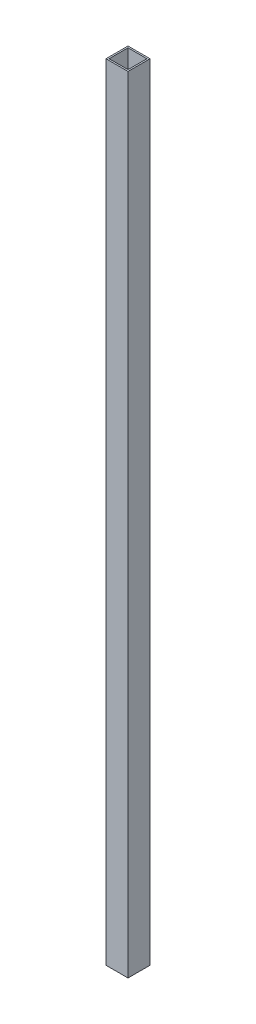
ISO-10303-21;
HEADER;
FILE_DESCRIPTION(('STEP AP214'),'2;1');
FILE_NAME('part.step','',(''),(''),'','','');
FILE_SCHEMA(('AUTOMOTIVE_DESIGN { 1 0 10303 214 1 1 1 1 }'));
ENDSEC;
DATA;
#1=APPLICATION_CONTEXT('core data for automotive mechanical design processes');
#2=APPLICATION_PROTOCOL_DEFINITION('international standard','automotive_design',2000,#1);
#3=PRODUCT_CONTEXT('',#1,'mechanical');
#4=PRODUCT('Part','Part','',(#3));
#5=PRODUCT_RELATED_PRODUCT_CATEGORY('part','',(#4));
#6=PRODUCT_DEFINITION_FORMATION('','',#4);
#7=PRODUCT_DEFINITION_CONTEXT('part definition',#1,'design');
#8=PRODUCT_DEFINITION('design','',#6,#7);
#9=PRODUCT_DEFINITION_SHAPE('','',#8);
#10=(LENGTH_UNIT() NAMED_UNIT(*) SI_UNIT(.MILLI.,.METRE.));
#11=(NAMED_UNIT(*) PLANE_ANGLE_UNIT() SI_UNIT($,.RADIAN.));
#12=(NAMED_UNIT(*) SI_UNIT($,.STERADIAN.) SOLID_ANGLE_UNIT());
#13=UNCERTAINTY_MEASURE_WITH_UNIT(LENGTH_MEASURE(1.E-05),#10,'distance_accuracy_value','');
#14=(GEOMETRIC_REPRESENTATION_CONTEXT(3) GLOBAL_UNCERTAINTY_ASSIGNED_CONTEXT((#13)) GLOBAL_UNIT_ASSIGNED_CONTEXT((#10,
#11,#12)) REPRESENTATION_CONTEXT('',''));
#15=CARTESIAN_POINT('',(0.,0.,0.));
#16=DIRECTION('',(0.,0.,1.));
#17=DIRECTION('',(1.,0.,0.));
#18=AXIS2_PLACEMENT_3D('',#15,#16,#17);
#19=CARTESIAN_POINT('',(0.,606.,0.));
#20=DIRECTION('',(0.,1.,0.));
#21=DIRECTION('',(0.,0.,1.));
#22=AXIS2_PLACEMENT_3D('',#19,#20,#21);
#23=PLANE('',#22);
#24=DIRECTION('',(0.,0.,1.));
#25=VECTOR('',#24,1.);
#26=CARTESIAN_POINT('',(-8.5,606.,-8.5));
#27=LINE('',#26,#25);
#28=CARTESIAN_POINT('',(-8.5,606.,-8.5));
#29=VERTEX_POINT('',#28);
#30=CARTESIAN_POINT('',(-8.5,606.,8.5));
#31=VERTEX_POINT('',#30);
#32=EDGE_CURVE('E176',#29,#31,#27,.T.);
#33=ORIENTED_EDGE('',*,*,#32,.T.);
#34=DIRECTION('',(1.,0.,0.));
#35=VECTOR('',#34,1.);
#36=CARTESIAN_POINT('',(-8.5,606.,8.5));
#37=LINE('',#36,#35);
#38=CARTESIAN_POINT('',(8.5,606.,8.5));
#39=VERTEX_POINT('',#38);
#40=EDGE_CURVE('E180',#31,#39,#37,.T.);
#41=ORIENTED_EDGE('',*,*,#40,.T.);
#42=DIRECTION('',(0.,0.,1.));
#43=VECTOR('',#42,1.);
#44=CARTESIAN_POINT('',(8.5,606.,-8.5));
#45=LINE('',#44,#43);
#46=CARTESIAN_POINT('',(8.5,606.,-8.5));
#47=VERTEX_POINT('',#46);
#48=EDGE_CURVE('E184',#47,#39,#45,.T.);
#49=ORIENTED_EDGE('',*,*,#48,.F.);
#50=DIRECTION('',(1.,0.,0.));
#51=VECTOR('',#50,1.);
#52=CARTESIAN_POINT('',(-8.5,606.,-8.5));
#53=LINE('',#52,#51);
#54=EDGE_CURVE('E188',#29,#47,#53,.T.);
#55=ORIENTED_EDGE('',*,*,#54,.F.);
#56=EDGE_LOOP('',(#33,#41,#49,#55));
#57=FACE_BOUND('',#56,.T.);
#58=DIRECTION('',(1.,0.,0.));
#59=VECTOR('',#58,1.);
#60=CARTESIAN_POINT('',(-7.3,606.,7.3));
#61=LINE('',#60,#59);
#62=CARTESIAN_POINT('',(-7.3,606.,7.3));
#63=VERTEX_POINT('',#62);
#64=CARTESIAN_POINT('',(7.3,606.,7.3));
#65=VERTEX_POINT('',#64);
#66=EDGE_CURVE('E139',#63,#65,#61,.T.);
#67=ORIENTED_EDGE('',*,*,#66,.F.);
#68=DIRECTION('',(0.,0.,1.));
#69=VECTOR('',#68,1.);
#70=CARTESIAN_POINT('',(-7.3,606.,-7.3));
#71=LINE('',#70,#69);
#72=CARTESIAN_POINT('',(-7.3,606.,-7.3));
#73=VERTEX_POINT('',#72);
#74=EDGE_CURVE('E129',#73,#63,#71,.T.);
#75=ORIENTED_EDGE('',*,*,#74,.F.);
#76=DIRECTION('',(1.,0.,0.));
#77=VECTOR('',#76,1.);
#78=CARTESIAN_POINT('',(-7.3,606.,-7.3));
#79=LINE('',#78,#77);
#80=CARTESIAN_POINT('',(7.3,606.,-7.3));
#81=VERTEX_POINT('',#80);
#82=EDGE_CURVE('E153',#73,#81,#79,.T.);
#83=ORIENTED_EDGE('',*,*,#82,.T.);
#84=DIRECTION('',(0.,0.,1.));
#85=VECTOR('',#84,1.);
#86=CARTESIAN_POINT('',(7.3,606.,-7.3));
#87=LINE('',#86,#85);
#88=EDGE_CURVE('E79',#81,#65,#87,.T.);
#89=ORIENTED_EDGE('',*,*,#88,.T.);
#90=EDGE_LOOP('',(#67,#75,#83,#89));
#91=FACE_BOUND('',#90,.T.);
#92=ADVANCED_FACE('F63',(#57,#91),#23,.T.);
#93=CARTESIAN_POINT('',(0.,0.,0.));
#94=DIRECTION('',(0.,1.,0.));
#95=DIRECTION('',(0.,0.,1.));
#96=AXIS2_PLACEMENT_3D('',#93,#94,#95);
#97=PLANE('',#96);
#98=DIRECTION('',(0.,0.,1.));
#99=VECTOR('',#98,1.);
#100=CARTESIAN_POINT('',(-8.5,0.,-8.5));
#101=LINE('',#100,#99);
#102=CARTESIAN_POINT('',(-8.5,0.,-8.5));
#103=VERTEX_POINT('',#102);
#104=CARTESIAN_POINT('',(-8.5,0.,8.5));
#105=VERTEX_POINT('',#104);
#106=EDGE_CURVE('E147',#103,#105,#101,.T.);
#107=ORIENTED_EDGE('',*,*,#106,.F.);
#108=DIRECTION('',(1.,0.,0.));
#109=VECTOR('',#108,1.);
#110=CARTESIAN_POINT('',(-8.5,0.,-8.5));
#111=LINE('',#110,#109);
#112=CARTESIAN_POINT('',(8.5,0.,-8.5));
#113=VERTEX_POINT('',#112);
#114=EDGE_CURVE('E181',#103,#113,#111,.T.);
#115=ORIENTED_EDGE('',*,*,#114,.T.);
#116=DIRECTION('',(0.,0.,1.));
#117=VECTOR('',#116,1.);
#118=CARTESIAN_POINT('',(8.5,0.,-8.5));
#119=LINE('',#118,#117);
#120=CARTESIAN_POINT('',(8.5,0.,8.5));
#121=VERTEX_POINT('',#120);
#122=EDGE_CURVE('E200',#113,#121,#119,.T.);
#123=ORIENTED_EDGE('',*,*,#122,.T.);
#124=DIRECTION('',(1.,0.,0.));
#125=VECTOR('',#124,1.);
#126=CARTESIAN_POINT('',(-8.5,0.,8.5));
#127=LINE('',#126,#125);
#128=EDGE_CURVE('E196',#105,#121,#127,.T.);
#129=ORIENTED_EDGE('',*,*,#128,.F.);
#130=EDGE_LOOP('',(#107,#115,#123,#129));
#131=FACE_BOUND('',#130,.T.);
#132=DIRECTION('',(0.,0.,1.));
#133=VECTOR('',#132,1.);
#134=CARTESIAN_POINT('',(-7.3,0.,-7.3));
#135=LINE('',#134,#133);
#136=CARTESIAN_POINT('',(-7.3,0.,-7.3));
#137=VERTEX_POINT('',#136);
#138=CARTESIAN_POINT('',(-7.3,0.,7.3));
#139=VERTEX_POINT('',#138);
#140=EDGE_CURVE('E87',#137,#139,#135,.T.);
#141=ORIENTED_EDGE('',*,*,#140,.T.);
#142=DIRECTION('',(1.,0.,0.));
#143=VECTOR('',#142,1.);
#144=CARTESIAN_POINT('',(-7.3,0.,7.3));
#145=LINE('',#144,#143);
#146=CARTESIAN_POINT('',(7.3,0.,7.3));
#147=VERTEX_POINT('',#146);
#148=EDGE_CURVE('E145',#139,#147,#145,.T.);
#149=ORIENTED_EDGE('',*,*,#148,.T.);
#150=DIRECTION('',(0.,0.,1.));
#151=VECTOR('',#150,1.);
#152=CARTESIAN_POINT('',(7.3,0.,-7.3));
#153=LINE('',#152,#151);
#154=CARTESIAN_POINT('',(7.3,0.,-7.3));
#155=VERTEX_POINT('',#154);
#156=EDGE_CURVE('E162',#155,#147,#153,.T.);
#157=ORIENTED_EDGE('',*,*,#156,.F.);
#158=DIRECTION('',(1.,0.,0.));
#159=VECTOR('',#158,1.);
#160=CARTESIAN_POINT('',(-7.3,0.,-7.3));
#161=LINE('',#160,#159);
#162=EDGE_CURVE('E140',#137,#155,#161,.T.);
#163=ORIENTED_EDGE('',*,*,#162,.F.);
#164=EDGE_LOOP('',(#141,#149,#157,#163));
#165=FACE_BOUND('',#164,.T.);
#166=ADVANCED_FACE('F222',(#131,#165),#97,.F.);
#167=CARTESIAN_POINT('',(-8.5,606.,-8.5));
#168=DIRECTION('',(1.,0.,0.));
#169=DIRECTION('',(0.,0.,-1.));
#170=AXIS2_PLACEMENT_3D('',#167,#168,#169);
#171=PLANE('',#170);
#172=ORIENTED_EDGE('',*,*,#106,.T.);
#173=DIRECTION('',(0.,-1.,0.));
#174=VECTOR('',#173,1.);
#175=CARTESIAN_POINT('',(-8.5,606.,8.5));
#176=LINE('',#175,#174);
#177=EDGE_CURVE('E12',#31,#105,#176,.T.);
#178=ORIENTED_EDGE('',*,*,#177,.F.);
#179=ORIENTED_EDGE('',*,*,#32,.F.);
#180=DIRECTION('',(0.,-1.,0.));
#181=VECTOR('',#180,1.);
#182=CARTESIAN_POINT('',(-8.5,606.,-8.5));
#183=LINE('',#182,#181);
#184=EDGE_CURVE('E192',#29,#103,#183,.T.);
#185=ORIENTED_EDGE('',*,*,#184,.T.);
#186=EDGE_LOOP('',(#172,#178,#179,#185));
#187=FACE_BOUND('',#186,.T.);
#188=ADVANCED_FACE('F65',(#187),#171,.F.);
#189=CARTESIAN_POINT('',(-8.5,606.,8.5));
#190=DIRECTION('',(0.,0.,-1.));
#191=DIRECTION('',(-1.,0.,0.));
#192=AXIS2_PLACEMENT_3D('',#189,#190,#191);
#193=PLANE('',#192);
#194=ORIENTED_EDGE('',*,*,#128,.T.);
#195=DIRECTION('',(0.,-1.,0.));
#196=VECTOR('',#195,1.);
#197=CARTESIAN_POINT('',(8.5,606.,8.5));
#198=LINE('',#197,#196);
#199=EDGE_CURVE('E72',#39,#121,#198,.T.);
#200=ORIENTED_EDGE('',*,*,#199,.F.);
#201=ORIENTED_EDGE('',*,*,#40,.F.);
#202=ORIENTED_EDGE('',*,*,#177,.T.);
#203=EDGE_LOOP('',(#194,#200,#201,#202));
#204=FACE_BOUND('',#203,.T.);
#205=ADVANCED_FACE('F218',(#204),#193,.F.);
#206=CARTESIAN_POINT('',(8.5,606.,-8.5));
#207=DIRECTION('',(1.,0.,0.));
#208=DIRECTION('',(0.,0.,-1.));
#209=AXIS2_PLACEMENT_3D('',#206,#207,#208);
#210=PLANE('',#209);
#211=ORIENTED_EDGE('',*,*,#122,.F.);
#212=DIRECTION('',(0.,-1.,0.));
#213=VECTOR('',#212,1.);
#214=CARTESIAN_POINT('',(8.5,606.,-8.5));
#215=LINE('',#214,#213);
#216=EDGE_CURVE('E209',#47,#113,#215,.T.);
#217=ORIENTED_EDGE('',*,*,#216,.F.);
#218=ORIENTED_EDGE('',*,*,#48,.T.);
#219=ORIENTED_EDGE('',*,*,#199,.T.);
#220=EDGE_LOOP('',(#211,#217,#218,#219));
#221=FACE_BOUND('',#220,.T.);
#222=ADVANCED_FACE('F215',(#221),#210,.T.);
#223=CARTESIAN_POINT('',(-8.5,606.,-8.5));
#224=DIRECTION('',(0.,0.,-1.));
#225=DIRECTION('',(-1.,0.,0.));
#226=AXIS2_PLACEMENT_3D('',#223,#224,#225);
#227=PLANE('',#226);
#228=ORIENTED_EDGE('',*,*,#114,.F.);
#229=ORIENTED_EDGE('',*,*,#184,.F.);
#230=ORIENTED_EDGE('',*,*,#54,.T.);
#231=ORIENTED_EDGE('',*,*,#216,.T.);
#232=EDGE_LOOP('',(#228,#229,#230,#231));
#233=FACE_BOUND('',#232,.T.);
#234=ADVANCED_FACE('F226',(#233),#227,.T.);
#235=CARTESIAN_POINT('',(-7.3,606.,-7.3));
#236=DIRECTION('',(1.,0.,0.));
#237=DIRECTION('',(0.,0.,-1.));
#238=AXIS2_PLACEMENT_3D('',#235,#236,#237);
#239=PLANE('',#238);
#240=ORIENTED_EDGE('',*,*,#140,.F.);
#241=DIRECTION('',(0.,-1.,0.));
#242=VECTOR('',#241,1.);
#243=CARTESIAN_POINT('',(-7.3,606.,-7.3));
#244=LINE('',#243,#242);
#245=EDGE_CURVE('E133',#73,#137,#244,.T.);
#246=ORIENTED_EDGE('',*,*,#245,.F.);
#247=ORIENTED_EDGE('',*,*,#74,.T.);
#248=DIRECTION('',(0.,-1.,0.));
#249=VECTOR('',#248,1.);
#250=CARTESIAN_POINT('',(-7.3,606.,7.3));
#251=LINE('',#250,#249);
#252=EDGE_CURVE('E132',#63,#139,#251,.T.);
#253=ORIENTED_EDGE('',*,*,#252,.T.);
#254=EDGE_LOOP('',(#240,#246,#247,#253));
#255=FACE_BOUND('',#254,.T.);
#256=ADVANCED_FACE('F131',(#255),#239,.T.);
#257=CARTESIAN_POINT('',(-7.3,606.,7.3));
#258=DIRECTION('',(0.,0.,-1.));
#259=DIRECTION('',(-1.,0.,0.));
#260=AXIS2_PLACEMENT_3D('',#257,#258,#259);
#261=PLANE('',#260);
#262=ORIENTED_EDGE('',*,*,#148,.F.);
#263=ORIENTED_EDGE('',*,*,#252,.F.);
#264=ORIENTED_EDGE('',*,*,#66,.T.);
#265=DIRECTION('',(0.,-1.,0.));
#266=VECTOR('',#265,1.);
#267=CARTESIAN_POINT('',(7.3,606.,7.3));
#268=LINE('',#267,#266);
#269=EDGE_CURVE('E148',#65,#147,#268,.T.);
#270=ORIENTED_EDGE('',*,*,#269,.T.);
#271=EDGE_LOOP('',(#262,#263,#264,#270));
#272=FACE_BOUND('',#271,.T.);
#273=ADVANCED_FACE('F143',(#272),#261,.T.);
#274=CARTESIAN_POINT('',(7.3,606.,-7.3));
#275=DIRECTION('',(1.,0.,0.));
#276=DIRECTION('',(0.,0.,-1.));
#277=AXIS2_PLACEMENT_3D('',#274,#275,#276);
#278=PLANE('',#277);
#279=ORIENTED_EDGE('',*,*,#156,.T.);
#280=ORIENTED_EDGE('',*,*,#269,.F.);
#281=ORIENTED_EDGE('',*,*,#88,.F.);
#282=DIRECTION('',(0.,-1.,0.));
#283=VECTOR('',#282,1.);
#284=CARTESIAN_POINT('',(7.3,606.,-7.3));
#285=LINE('',#284,#283);
#286=EDGE_CURVE('E171',#81,#155,#285,.T.);
#287=ORIENTED_EDGE('',*,*,#286,.T.);
#288=EDGE_LOOP('',(#279,#280,#281,#287));
#289=FACE_BOUND('',#288,.T.);
#290=ADVANCED_FACE('F266',(#289),#278,.F.);
#291=CARTESIAN_POINT('',(-7.3,606.,-7.3));
#292=DIRECTION('',(0.,0.,-1.));
#293=DIRECTION('',(-1.,0.,0.));
#294=AXIS2_PLACEMENT_3D('',#291,#292,#293);
#295=PLANE('',#294);
#296=ORIENTED_EDGE('',*,*,#162,.T.);
#297=ORIENTED_EDGE('',*,*,#286,.F.);
#298=ORIENTED_EDGE('',*,*,#82,.F.);
#299=ORIENTED_EDGE('',*,*,#245,.T.);
#300=EDGE_LOOP('',(#296,#297,#298,#299));
#301=FACE_BOUND('',#300,.T.);
#302=ADVANCED_FACE('F272',(#301),#295,.F.);
#303=CLOSED_SHELL('',(#92,#166,#188,#205,#222,#234,#256,#273,#290,#302));
#304=MANIFOLD_SOLID_BREP('B2',#303);
#305=ADVANCED_BREP_SHAPE_REPRESENTATION('',(#18,#304),#14);
#306=SHAPE_DEFINITION_REPRESENTATION(#9,#305);
ENDSEC;
END-ISO-10303-21;
